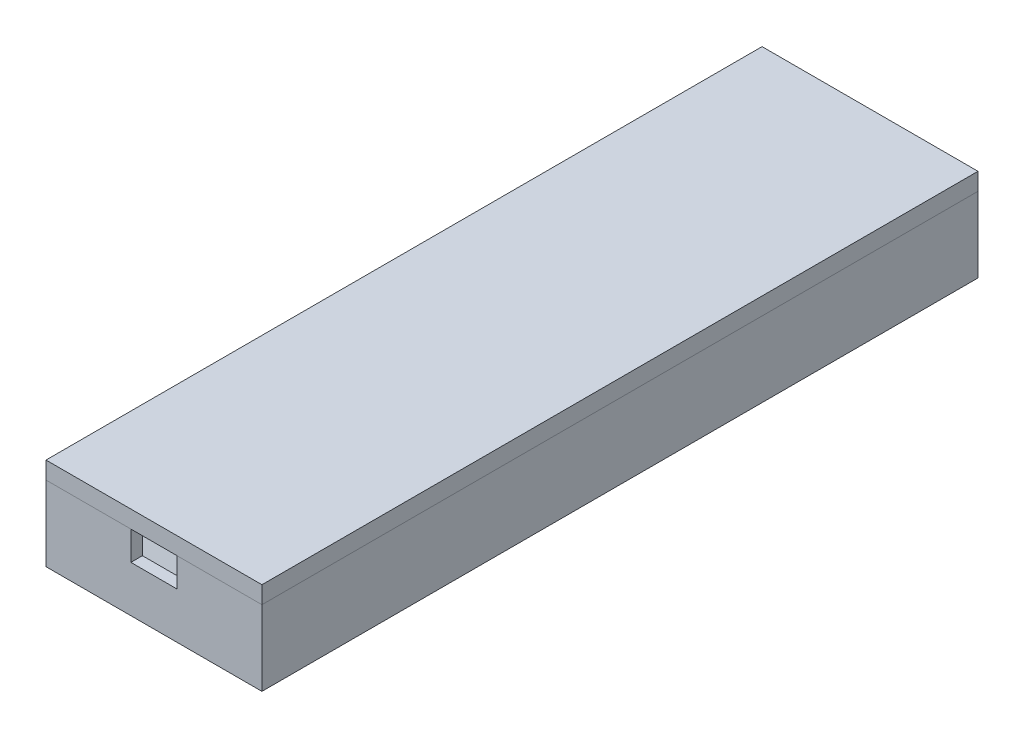
ISO-10303-21;
HEADER;
FILE_DESCRIPTION(('STEP AP214'),'2;1');
FILE_NAME('part.step','',(''),(''),'','','');
FILE_SCHEMA(('AUTOMOTIVE_DESIGN { 1 0 10303 214 1 1 1 1 }'));
ENDSEC;
DATA;
#1=APPLICATION_CONTEXT('core data for automotive mechanical design processes');
#2=APPLICATION_PROTOCOL_DEFINITION('international standard','automotive_design',2000,#1);
#3=PRODUCT_CONTEXT('',#1,'mechanical');
#4=PRODUCT('Part','Part','',(#3));
#5=PRODUCT_RELATED_PRODUCT_CATEGORY('part','',(#4));
#6=PRODUCT_DEFINITION_FORMATION('','',#4);
#7=PRODUCT_DEFINITION_CONTEXT('part definition',#1,'design');
#8=PRODUCT_DEFINITION('design','',#6,#7);
#9=PRODUCT_DEFINITION_SHAPE('','',#8);
#10=(LENGTH_UNIT() NAMED_UNIT(*) SI_UNIT(.MILLI.,.METRE.));
#11=(NAMED_UNIT(*) PLANE_ANGLE_UNIT() SI_UNIT($,.RADIAN.));
#12=(NAMED_UNIT(*) SI_UNIT($,.STERADIAN.) SOLID_ANGLE_UNIT());
#13=UNCERTAINTY_MEASURE_WITH_UNIT(LENGTH_MEASURE(1.E-05),#10,'distance_accuracy_value','');
#14=(GEOMETRIC_REPRESENTATION_CONTEXT(3) GLOBAL_UNCERTAINTY_ASSIGNED_CONTEXT((#13)) GLOBAL_UNIT_ASSIGNED_CONTEXT((#10,
#11,#12)) REPRESENTATION_CONTEXT('',''));
#15=CARTESIAN_POINT('',(0.,0.,0.));
#16=DIRECTION('',(0.,0.,1.));
#17=DIRECTION('',(1.,0.,0.));
#18=AXIS2_PLACEMENT_3D('',#15,#16,#17);
#19=CARTESIAN_POINT('',(-18.6968557711749,16.,-2.));
#20=DIRECTION('',(1.,0.,0.));
#21=DIRECTION('',(0.,1.,0.));
#22=AXIS2_PLACEMENT_3D('',#19,#20,#21);
#23=PLANE('',#22);
#24=DIRECTION('',(0.,0.,1.));
#25=VECTOR('',#24,1.);
#26=CARTESIAN_POINT('',(-18.6968557711749,13.,-2.));
#27=LINE('',#26,#25);
#28=CARTESIAN_POINT('',(-18.6968557711749,13.,-2.));
#29=VERTEX_POINT('',#28);
#30=CARTESIAN_POINT('',(-18.6968557711749,13.,122.));
#31=VERTEX_POINT('',#30);
#32=EDGE_CURVE('E106',#29,#31,#27,.T.);
#33=ORIENTED_EDGE('',*,*,#32,.T.);
#34=DIRECTION('',(0.,-1.,0.));
#35=VECTOR('',#34,1.);
#36=CARTESIAN_POINT('',(-18.6968557711749,16.,122.));
#37=LINE('',#36,#35);
#38=CARTESIAN_POINT('',(-18.6968557711749,16.,122.));
#39=VERTEX_POINT('',#38);
#40=EDGE_CURVE('E12',#39,#31,#37,.T.);
#41=ORIENTED_EDGE('',*,*,#40,.F.);
#42=DIRECTION('',(0.,0.,1.));
#43=VECTOR('',#42,1.);
#44=CARTESIAN_POINT('',(-18.6968557711749,16.,-2.));
#45=LINE('',#44,#43);
#46=CARTESIAN_POINT('',(-18.6968557711749,16.,-2.));
#47=VERTEX_POINT('',#46);
#48=EDGE_CURVE('E94',#47,#39,#45,.T.);
#49=ORIENTED_EDGE('',*,*,#48,.F.);
#50=DIRECTION('',(0.,-1.,0.));
#51=VECTOR('',#50,1.);
#52=CARTESIAN_POINT('',(-18.6968557711749,16.,-2.));
#53=LINE('',#52,#51);
#54=EDGE_CURVE('E102',#47,#29,#53,.T.);
#55=ORIENTED_EDGE('',*,*,#54,.T.);
#56=EDGE_LOOP('',(#33,#41,#49,#55));
#57=FACE_BOUND('',#56,.T.);
#58=ADVANCED_FACE('F43',(#57),#23,.F.);
#59=CARTESIAN_POINT('',(-18.6968557711749,16.,122.));
#60=DIRECTION('',(0.,0.,-1.));
#61=DIRECTION('',(-1.,0.,0.));
#62=AXIS2_PLACEMENT_3D('',#59,#60,#61);
#63=PLANE('',#62);
#64=DIRECTION('',(1.,0.,0.));
#65=VECTOR('',#64,1.);
#66=CARTESIAN_POINT('',(-18.6968557711749,13.,122.));
#67=LINE('',#66,#65);
#68=CARTESIAN_POINT('',(18.6968557711749,13.,122.));
#69=VERTEX_POINT('',#68);
#70=EDGE_CURVE('E98',#31,#69,#67,.T.);
#71=ORIENTED_EDGE('',*,*,#70,.T.);
#72=DIRECTION('',(0.,-1.,0.));
#73=VECTOR('',#72,1.);
#74=CARTESIAN_POINT('',(18.6968557711749,16.,122.));
#75=LINE('',#74,#73);
#76=CARTESIAN_POINT('',(18.6968557711749,16.,122.));
#77=VERTEX_POINT('',#76);
#78=EDGE_CURVE('E51',#77,#69,#75,.T.);
#79=ORIENTED_EDGE('',*,*,#78,.F.);
#80=DIRECTION('',(1.,0.,0.));
#81=VECTOR('',#80,1.);
#82=CARTESIAN_POINT('',(-18.6968557711749,16.,122.));
#83=LINE('',#82,#81);
#84=EDGE_CURVE('E89',#39,#77,#83,.T.);
#85=ORIENTED_EDGE('',*,*,#84,.F.);
#86=ORIENTED_EDGE('',*,*,#40,.T.);
#87=EDGE_LOOP('',(#71,#79,#85,#86));
#88=FACE_BOUND('',#87,.T.);
#89=ADVANCED_FACE('F97',(#88),#63,.F.);
#90=CARTESIAN_POINT('',(18.6968557711749,16.,-2.));
#91=DIRECTION('',(-1.,0.,0.));
#92=DIRECTION('',(0.,-1.,0.));
#93=AXIS2_PLACEMENT_3D('',#90,#91,#92);
#94=PLANE('',#93);
#95=DIRECTION('',(0.,0.,-1.));
#96=VECTOR('',#95,1.);
#97=CARTESIAN_POINT('',(18.6968557711749,13.,-2.));
#98=LINE('',#97,#96);
#99=CARTESIAN_POINT('',(18.6968557711749,13.,-2.));
#100=VERTEX_POINT('',#99);
#101=EDGE_CURVE('E76',#69,#100,#98,.T.);
#102=ORIENTED_EDGE('',*,*,#101,.T.);
#103=DIRECTION('',(0.,-1.,0.));
#104=VECTOR('',#103,1.);
#105=CARTESIAN_POINT('',(18.6968557711749,16.,-2.));
#106=LINE('',#105,#104);
#107=CARTESIAN_POINT('',(18.6968557711749,16.,-2.));
#108=VERTEX_POINT('',#107);
#109=EDGE_CURVE('E99',#108,#100,#106,.T.);
#110=ORIENTED_EDGE('',*,*,#109,.F.);
#111=DIRECTION('',(0.,0.,-1.));
#112=VECTOR('',#111,1.);
#113=CARTESIAN_POINT('',(18.6968557711749,16.,-2.));
#114=LINE('',#113,#112);
#115=EDGE_CURVE('E92',#77,#108,#114,.T.);
#116=ORIENTED_EDGE('',*,*,#115,.F.);
#117=ORIENTED_EDGE('',*,*,#78,.T.);
#118=EDGE_LOOP('',(#102,#110,#116,#117));
#119=FACE_BOUND('',#118,.T.);
#120=ADVANCED_FACE('F100',(#119),#94,.F.);
#121=CARTESIAN_POINT('',(-18.6968557711749,16.,-2.));
#122=DIRECTION('',(0.,0.,1.));
#123=DIRECTION('',(1.,0.,0.));
#124=AXIS2_PLACEMENT_3D('',#121,#122,#123);
#125=PLANE('',#124);
#126=DIRECTION('',(-1.,0.,0.));
#127=VECTOR('',#126,1.);
#128=CARTESIAN_POINT('',(-18.6968557711749,13.,-2.));
#129=LINE('',#128,#127);
#130=EDGE_CURVE('E82',#100,#29,#129,.T.);
#131=ORIENTED_EDGE('',*,*,#130,.T.);
#132=ORIENTED_EDGE('',*,*,#54,.F.);
#133=DIRECTION('',(-1.,0.,0.));
#134=VECTOR('',#133,1.);
#135=CARTESIAN_POINT('',(-18.6968557711749,16.,-2.));
#136=LINE('',#135,#134);
#137=EDGE_CURVE('E59',#108,#47,#136,.T.);
#138=ORIENTED_EDGE('',*,*,#137,.F.);
#139=ORIENTED_EDGE('',*,*,#109,.T.);
#140=EDGE_LOOP('',(#131,#132,#138,#139));
#141=FACE_BOUND('',#140,.T.);
#142=ADVANCED_FACE('F113',(#141),#125,.F.);
#143=CARTESIAN_POINT('',(0.,16.,0.));
#144=DIRECTION('',(0.,1.,0.));
#145=DIRECTION('',(-1.,0.,0.));
#146=AXIS2_PLACEMENT_3D('',#143,#144,#145);
#147=PLANE('',#146);
#148=ORIENTED_EDGE('',*,*,#48,.T.);
#149=ORIENTED_EDGE('',*,*,#84,.T.);
#150=ORIENTED_EDGE('',*,*,#115,.T.);
#151=ORIENTED_EDGE('',*,*,#137,.T.);
#152=EDGE_LOOP('',(#148,#149,#150,#151));
#153=FACE_BOUND('',#152,.T.);
#154=ADVANCED_FACE('F90',(#153),#147,.T.);
#155=CARTESIAN_POINT('',(0.,13.,0.));
#156=DIRECTION('',(0.,1.,0.));
#157=DIRECTION('',(-1.,0.,0.));
#158=AXIS2_PLACEMENT_3D('',#155,#156,#157);
#159=PLANE('',#158);
#160=ORIENTED_EDGE('',*,*,#32,.F.);
#161=ORIENTED_EDGE('',*,*,#130,.F.);
#162=ORIENTED_EDGE('',*,*,#101,.F.);
#163=ORIENTED_EDGE('',*,*,#70,.F.);
#164=EDGE_LOOP('',(#160,#161,#162,#163));
#165=FACE_BOUND('',#164,.T.);
#166=ADVANCED_FACE('F116',(#165),#159,.F.);
#167=CLOSED_SHELL('',(#58,#89,#120,#142,#154,#166));
#168=MANIFOLD_SOLID_BREP('B2',#167);
#169=CARTESIAN_POINT('',(-18.6968557711749,13.,120.));
#170=DIRECTION('',(1.,0.,0.));
#171=DIRECTION('',(0.,1.,0.));
#172=AXIS2_PLACEMENT_3D('',#169,#170,#171);
#173=PLANE('',#172);
#174=DIRECTION('',(0.,0.,-1.));
#175=VECTOR('',#174,1.);
#176=CARTESIAN_POINT('',(-18.6968557711749,13.,120.));
#177=LINE('',#176,#175);
#178=CARTESIAN_POINT('',(-18.6968557711749,13.,122.));
#179=VERTEX_POINT('',#178);
#180=CARTESIAN_POINT('',(-18.6968557711749,13.,-2.));
#181=VERTEX_POINT('',#180);
#182=EDGE_CURVE('E323',#179,#181,#177,.T.);
#183=ORIENTED_EDGE('',*,*,#182,.T.);
#184=DIRECTION('',(0.,1.,0.));
#185=VECTOR('',#184,1.);
#186=CARTESIAN_POINT('',(-18.6968557711749,0.,-2.));
#187=LINE('',#186,#185);
#188=CARTESIAN_POINT('',(-18.6968557711749,0.,-2.));
#189=VERTEX_POINT('',#188);
#190=EDGE_CURVE('E330',#189,#181,#187,.T.);
#191=ORIENTED_EDGE('',*,*,#190,.F.);
#192=DIRECTION('',(0.,0.,-1.));
#193=VECTOR('',#192,1.);
#194=CARTESIAN_POINT('',(-18.6968557711749,0.,120.));
#195=LINE('',#194,#193);
#196=CARTESIAN_POINT('',(-18.6968557711749,0.,122.));
#197=VERTEX_POINT('',#196);
#198=EDGE_CURVE('E307',#197,#189,#195,.T.);
#199=ORIENTED_EDGE('',*,*,#198,.F.);
#200=DIRECTION('',(0.,-1.,0.));
#201=VECTOR('',#200,1.);
#202=CARTESIAN_POINT('',(-18.6968557711749,0.,122.));
#203=LINE('',#202,#201);
#204=EDGE_CURVE('E284',#179,#197,#203,.T.);
#205=ORIENTED_EDGE('',*,*,#204,.F.);
#206=EDGE_LOOP('',(#183,#191,#199,#205));
#207=FACE_BOUND('',#206,.T.);
#208=ADVANCED_FACE('F167',(#207),#173,.F.);
#209=CARTESIAN_POINT('',(-18.6968557711749,0.,120.));
#210=DIRECTION('',(0.,1.,0.));
#211=DIRECTION('',(-1.,0.,0.));
#212=AXIS2_PLACEMENT_3D('',#209,#210,#211);
#213=PLANE('',#212);
#214=ORIENTED_EDGE('',*,*,#198,.T.);
#215=DIRECTION('',(-1.,0.,0.));
#216=VECTOR('',#215,1.);
#217=CARTESIAN_POINT('',(18.6968557711749,0.,-2.));
#218=LINE('',#217,#216);
#219=CARTESIAN_POINT('',(18.6968557711749,0.,-2.));
#220=VERTEX_POINT('',#219);
#221=EDGE_CURVE('E337',#220,#189,#218,.T.);
#222=ORIENTED_EDGE('',*,*,#221,.F.);
#223=DIRECTION('',(0.,0.,-1.));
#224=VECTOR('',#223,1.);
#225=CARTESIAN_POINT('',(18.6968557711749,0.,120.));
#226=LINE('',#225,#224);
#227=CARTESIAN_POINT('',(18.6968557711749,0.,122.));
#228=VERTEX_POINT('',#227);
#229=EDGE_CURVE('E334',#228,#220,#226,.T.);
#230=ORIENTED_EDGE('',*,*,#229,.F.);
#231=DIRECTION('',(1.,0.,0.));
#232=VECTOR('',#231,1.);
#233=CARTESIAN_POINT('',(-18.6968557711749,0.,122.));
#234=LINE('',#233,#232);
#235=EDGE_CURVE('E287',#197,#228,#234,.T.);
#236=ORIENTED_EDGE('',*,*,#235,.F.);
#237=EDGE_LOOP('',(#214,#222,#230,#236));
#238=FACE_BOUND('',#237,.T.);
#239=ADVANCED_FACE('F336',(#238),#213,.F.);
#240=CARTESIAN_POINT('',(18.6968557711749,0.,120.));
#241=DIRECTION('',(-1.,0.,0.));
#242=DIRECTION('',(0.,-1.,0.));
#243=AXIS2_PLACEMENT_3D('',#240,#241,#242);
#244=PLANE('',#243);
#245=ORIENTED_EDGE('',*,*,#229,.T.);
#246=DIRECTION('',(0.,-1.,0.));
#247=VECTOR('',#246,1.);
#248=CARTESIAN_POINT('',(18.6968557711749,0.,-2.));
#249=LINE('',#248,#247);
#250=CARTESIAN_POINT('',(18.6968557711749,13.,-2.));
#251=VERTEX_POINT('',#250);
#252=EDGE_CURVE('E374',#251,#220,#249,.T.);
#253=ORIENTED_EDGE('',*,*,#252,.F.);
#254=DIRECTION('',(0.,0.,-1.));
#255=VECTOR('',#254,1.);
#256=CARTESIAN_POINT('',(18.6968557711749,13.,120.));
#257=LINE('',#256,#255);
#258=CARTESIAN_POINT('',(18.6968557711749,13.,122.));
#259=VERTEX_POINT('',#258);
#260=EDGE_CURVE('E341',#259,#251,#257,.T.);
#261=ORIENTED_EDGE('',*,*,#260,.F.);
#262=DIRECTION('',(0.,1.,0.));
#263=VECTOR('',#262,1.);
#264=CARTESIAN_POINT('',(18.6968557711749,0.,122.));
#265=LINE('',#264,#263);
#266=EDGE_CURVE('E291',#228,#259,#265,.T.);
#267=ORIENTED_EDGE('',*,*,#266,.F.);
#268=EDGE_LOOP('',(#245,#253,#261,#267));
#269=FACE_BOUND('',#268,.T.);
#270=ADVANCED_FACE('F373',(#269),#244,.F.);
#271=CARTESIAN_POINT('',(15.6968557711749,13.,120.));
#272=DIRECTION('',(0.537299608346824,-0.843391445812886,0.));
#273=DIRECTION('',(0.843391445812886,0.537299608346824,0.));
#274=AXIS2_PLACEMENT_3D('',#271,#272,#273);
#275=PLANE('',#274);
#276=DIRECTION('',(-0.843391445812886,-0.537299608346824,0.));
#277=VECTOR('',#276,1.);
#278=CARTESIAN_POINT('',(15.6968557711749,13.,0.));
#279=LINE('',#278,#277);
#280=CARTESIAN_POINT('',(15.6968557711749,13.,0.));
#281=VERTEX_POINT('',#280);
#282=CARTESIAN_POINT('',(0.,2.99999999999999,0.));
#283=VERTEX_POINT('',#282);
#284=EDGE_CURVE('E204',#281,#283,#279,.T.);
#285=ORIENTED_EDGE('',*,*,#284,.T.);
#286=DIRECTION('',(0.,0.,-1.));
#287=VECTOR('',#286,1.);
#288=CARTESIAN_POINT('',(0.,2.99999999999999,120.));
#289=LINE('',#288,#287);
#290=CARTESIAN_POINT('',(0.,2.99999999999999,120.));
#291=VERTEX_POINT('',#290);
#292=EDGE_CURVE('E190',#291,#283,#289,.T.);
#293=ORIENTED_EDGE('',*,*,#292,.F.);
#294=DIRECTION('',(-0.843391445812886,-0.537299608346824,0.));
#295=VECTOR('',#294,1.);
#296=CARTESIAN_POINT('',(15.6968557711749,13.,120.));
#297=LINE('',#296,#295);
#298=CARTESIAN_POINT('',(15.6968557711749,13.,120.));
#299=VERTEX_POINT('',#298);
#300=EDGE_CURVE('E357',#299,#291,#297,.T.);
#301=ORIENTED_EDGE('',*,*,#300,.F.);
#302=DIRECTION('',(0.,0.,-1.));
#303=VECTOR('',#302,1.);
#304=CARTESIAN_POINT('',(15.6968557711749,13.,120.));
#305=LINE('',#304,#303);
#306=EDGE_CURVE('E343',#299,#281,#305,.T.);
#307=ORIENTED_EDGE('',*,*,#306,.T.);
#308=EDGE_LOOP('',(#285,#293,#301,#307));
#309=FACE_BOUND('',#308,.T.);
#310=ADVANCED_FACE('F371',(#309),#275,.F.);
#311=CARTESIAN_POINT('',(0.,2.99999999999999,120.));
#312=DIRECTION('',(-0.537299608346824,-0.843391445812886,0.));
#313=DIRECTION('',(0.843391445812886,-0.537299608346824,0.));
#314=AXIS2_PLACEMENT_3D('',#311,#312,#313);
#315=PLANE('',#314);
#316=DIRECTION('',(-0.843391445812886,0.537299608346824,0.));
#317=VECTOR('',#316,1.);
#318=CARTESIAN_POINT('',(0.,2.99999999999999,0.));
#319=LINE('',#318,#317);
#320=CARTESIAN_POINT('',(-15.6968557711749,13.,0.));
#321=VERTEX_POINT('',#320);
#322=EDGE_CURVE('E202',#283,#321,#319,.T.);
#323=ORIENTED_EDGE('',*,*,#322,.T.);
#324=DIRECTION('',(0.,0.,-1.));
#325=VECTOR('',#324,1.);
#326=CARTESIAN_POINT('',(-15.6968557711749,13.,120.));
#327=LINE('',#326,#325);
#328=CARTESIAN_POINT('',(-15.696855771175,13.,120.));
#329=VERTEX_POINT('',#328);
#330=EDGE_CURVE('E358',#329,#321,#327,.T.);
#331=ORIENTED_EDGE('',*,*,#330,.F.);
#332=DIRECTION('',(-0.843391445812886,0.537299608346824,0.));
#333=VECTOR('',#332,1.);
#334=CARTESIAN_POINT('',(0.,2.99999999999999,120.));
#335=LINE('',#334,#333);
#336=EDGE_CURVE('E365',#291,#329,#335,.T.);
#337=ORIENTED_EDGE('',*,*,#336,.F.);
#338=ORIENTED_EDGE('',*,*,#292,.T.);
#339=EDGE_LOOP('',(#323,#331,#337,#338));
#340=FACE_BOUND('',#339,.T.);
#341=ADVANCED_FACE('F367',(#340),#315,.F.);
#342=CARTESIAN_POINT('',(-15.6968557711749,13.,120.));
#343=DIRECTION('',(0.,-1.,0.));
#344=DIRECTION('',(0.,0.,-1.));
#345=AXIS2_PLACEMENT_3D('',#342,#343,#344);
#346=PLANE('',#345);
#347=DIRECTION('',(-1.,0.,0.));
#348=VECTOR('',#347,1.);
#349=CARTESIAN_POINT('',(-18.6968557711749,13.,122.));
#350=LINE('',#349,#348);
#351=CARTESIAN_POINT('',(-4.,13.,122.));
#352=VERTEX_POINT('',#351);
#353=EDGE_CURVE('E294',#352,#179,#350,.T.);
#354=ORIENTED_EDGE('',*,*,#353,.F.);
#355=DIRECTION('',(0.,0.,1.));
#356=VECTOR('',#355,1.);
#357=CARTESIAN_POINT('',(-4.,13.,119.));
#358=LINE('',#357,#356);
#359=CARTESIAN_POINT('',(-4.,13.,120.));
#360=VERTEX_POINT('',#359);
#361=EDGE_CURVE('E269',#360,#352,#358,.T.);
#362=ORIENTED_EDGE('',*,*,#361,.F.);
#363=DIRECTION('',(-1.,0.,0.));
#364=VECTOR('',#363,1.);
#365=CARTESIAN_POINT('',(-18.6968557711749,13.,120.));
#366=LINE('',#365,#364);
#367=EDGE_CURVE('E279',#360,#329,#366,.T.);
#368=ORIENTED_EDGE('',*,*,#367,.T.);
#369=ORIENTED_EDGE('',*,*,#330,.T.);
#370=DIRECTION('',(1.,0.,0.));
#371=VECTOR('',#370,1.);
#372=CARTESIAN_POINT('',(18.6968557711749,13.,0.));
#373=LINE('',#372,#371);
#374=EDGE_CURVE('E297',#321,#281,#373,.T.);
#375=ORIENTED_EDGE('',*,*,#374,.T.);
#376=ORIENTED_EDGE('',*,*,#306,.F.);
#377=CARTESIAN_POINT('',(4.,13.,120.));
#378=VERTEX_POINT('',#377);
#379=EDGE_CURVE('E288',#299,#378,#366,.T.);
#380=ORIENTED_EDGE('',*,*,#379,.T.);
#381=DIRECTION('',(0.,0.,1.));
#382=VECTOR('',#381,1.);
#383=CARTESIAN_POINT('',(4.,13.,119.));
#384=LINE('',#383,#382);
#385=CARTESIAN_POINT('',(4.,13.,122.));
#386=VERTEX_POINT('',#385);
#387=EDGE_CURVE('E280',#378,#386,#384,.T.);
#388=ORIENTED_EDGE('',*,*,#387,.T.);
#389=EDGE_CURVE('E295',#259,#386,#350,.T.);
#390=ORIENTED_EDGE('',*,*,#389,.F.);
#391=ORIENTED_EDGE('',*,*,#260,.T.);
#392=DIRECTION('',(1.,0.,0.));
#393=VECTOR('',#392,1.);
#394=CARTESIAN_POINT('',(18.6968557711749,13.,-2.));
#395=LINE('',#394,#393);
#396=EDGE_CURVE('E348',#181,#251,#395,.T.);
#397=ORIENTED_EDGE('',*,*,#396,.F.);
#398=ORIENTED_EDGE('',*,*,#182,.F.);
#399=EDGE_LOOP('',(#354,#362,#368,#369,#375,#376,#380,#388,#390,#391,#397,#398));
#400=FACE_BOUND('',#399,.T.);
#401=ADVANCED_FACE('F318',(#400),#346,.F.);
#402=CARTESIAN_POINT('',(0.,0.,0.));
#403=DIRECTION('',(0.,0.,1.));
#404=DIRECTION('',(1.,0.,0.));
#405=AXIS2_PLACEMENT_3D('',#402,#403,#404);
#406=PLANE('',#405);
#407=ORIENTED_EDGE('',*,*,#322,.F.);
#408=ORIENTED_EDGE('',*,*,#284,.F.);
#409=ORIENTED_EDGE('',*,*,#374,.F.);
#410=EDGE_LOOP('',(#407,#408,#409));
#411=FACE_BOUND('',#410,.T.);
#412=ADVANCED_FACE('F384',(#411),#406,.T.);
#413=CARTESIAN_POINT('',(0.,0.,-2.));
#414=DIRECTION('',(0.,0.,1.));
#415=DIRECTION('',(1.,0.,0.));
#416=AXIS2_PLACEMENT_3D('',#413,#414,#415);
#417=PLANE('',#416);
#418=ORIENTED_EDGE('',*,*,#252,.T.);
#419=ORIENTED_EDGE('',*,*,#221,.T.);
#420=ORIENTED_EDGE('',*,*,#190,.T.);
#421=ORIENTED_EDGE('',*,*,#396,.T.);
#422=EDGE_LOOP('',(#418,#419,#420,#421));
#423=FACE_BOUND('',#422,.T.);
#424=ADVANCED_FACE('F377',(#423),#417,.F.);
#425=CARTESIAN_POINT('',(0.,0.,122.));
#426=DIRECTION('',(0.,0.,-1.));
#427=DIRECTION('',(-1.,0.,0.));
#428=AXIS2_PLACEMENT_3D('',#425,#426,#427);
#429=PLANE('',#428);
#430=DIRECTION('',(1.,0.,0.));
#431=VECTOR('',#430,1.);
#432=CARTESIAN_POINT('',(-4.,8.00000000000001,122.));
#433=LINE('',#432,#431);
#434=CARTESIAN_POINT('',(-4.,8.00000000000001,122.));
#435=VERTEX_POINT('',#434);
#436=CARTESIAN_POINT('',(4.,8.00000000000001,122.));
#437=VERTEX_POINT('',#436);
#438=EDGE_CURVE('E257',#435,#437,#433,.T.);
#439=ORIENTED_EDGE('',*,*,#438,.F.);
#440=DIRECTION('',(0.,-1.,0.));
#441=VECTOR('',#440,1.);
#442=CARTESIAN_POINT('',(-4.,13.,122.));
#443=LINE('',#442,#441);
#444=EDGE_CURVE('E266',#352,#435,#443,.T.);
#445=ORIENTED_EDGE('',*,*,#444,.F.);
#446=ORIENTED_EDGE('',*,*,#353,.T.);
#447=ORIENTED_EDGE('',*,*,#204,.T.);
#448=ORIENTED_EDGE('',*,*,#235,.T.);
#449=ORIENTED_EDGE('',*,*,#266,.T.);
#450=ORIENTED_EDGE('',*,*,#389,.T.);
#451=DIRECTION('',(0.,1.,0.));
#452=VECTOR('',#451,1.);
#453=CARTESIAN_POINT('',(4.,13.,122.));
#454=LINE('',#453,#452);
#455=EDGE_CURVE('E263',#437,#386,#454,.T.);
#456=ORIENTED_EDGE('',*,*,#455,.F.);
#457=EDGE_LOOP('',(#439,#445,#446,#447,#448,#449,#450,#456));
#458=FACE_BOUND('',#457,.T.);
#459=ADVANCED_FACE('F273',(#458),#429,.F.);
#460=CARTESIAN_POINT('',(0.,0.,120.));
#461=DIRECTION('',(0.,0.,-1.));
#462=DIRECTION('',(-1.,0.,0.));
#463=AXIS2_PLACEMENT_3D('',#460,#461,#462);
#464=PLANE('',#463);
#465=DIRECTION('',(0.,1.,0.));
#466=VECTOR('',#465,1.);
#467=CARTESIAN_POINT('',(-4.,0.,120.));
#468=LINE('',#467,#466);
#469=CARTESIAN_POINT('',(-4.,8.00000000000001,120.));
#470=VERTEX_POINT('',#469);
#471=EDGE_CURVE('E41',#470,#360,#468,.T.);
#472=ORIENTED_EDGE('',*,*,#471,.F.);
#473=DIRECTION('',(-1.,0.,0.));
#474=VECTOR('',#473,1.);
#475=CARTESIAN_POINT('',(0.,8.00000000000001,120.));
#476=LINE('',#475,#474);
#477=CARTESIAN_POINT('',(4.,8.00000000000001,120.));
#478=VERTEX_POINT('',#477);
#479=EDGE_CURVE('E260',#478,#470,#476,.T.);
#480=ORIENTED_EDGE('',*,*,#479,.F.);
#481=DIRECTION('',(0.,-1.,0.));
#482=VECTOR('',#481,1.);
#483=CARTESIAN_POINT('',(4.,0.,120.));
#484=LINE('',#483,#482);
#485=EDGE_CURVE('E174',#378,#478,#484,.T.);
#486=ORIENTED_EDGE('',*,*,#485,.F.);
#487=ORIENTED_EDGE('',*,*,#379,.F.);
#488=ORIENTED_EDGE('',*,*,#300,.T.);
#489=ORIENTED_EDGE('',*,*,#336,.T.);
#490=ORIENTED_EDGE('',*,*,#367,.F.);
#491=EDGE_LOOP('',(#472,#480,#486,#487,#488,#489,#490));
#492=FACE_BOUND('',#491,.T.);
#493=ADVANCED_FACE('F314',(#492),#464,.T.);
#494=CARTESIAN_POINT('',(-4.,13.,119.));
#495=DIRECTION('',(-1.,0.,0.));
#496=DIRECTION('',(0.,-1.,0.));
#497=AXIS2_PLACEMENT_3D('',#494,#495,#496);
#498=PLANE('',#497);
#499=ORIENTED_EDGE('',*,*,#471,.T.);
#500=ORIENTED_EDGE('',*,*,#361,.T.);
#501=ORIENTED_EDGE('',*,*,#444,.T.);
#502=DIRECTION('',(0.,0.,1.));
#503=VECTOR('',#502,1.);
#504=CARTESIAN_POINT('',(-4.,8.00000000000001,119.));
#505=LINE('',#504,#503);
#506=EDGE_CURVE('E253',#470,#435,#505,.T.);
#507=ORIENTED_EDGE('',*,*,#506,.F.);
#508=EDGE_LOOP('',(#499,#500,#501,#507));
#509=FACE_BOUND('',#508,.T.);
#510=ADVANCED_FACE('F267',(#509),#498,.F.);
#511=CARTESIAN_POINT('',(4.,13.,119.));
#512=DIRECTION('',(1.,0.,0.));
#513=DIRECTION('',(0.,1.,0.));
#514=AXIS2_PLACEMENT_3D('',#511,#512,#513);
#515=PLANE('',#514);
#516=ORIENTED_EDGE('',*,*,#485,.T.);
#517=DIRECTION('',(0.,0.,1.));
#518=VECTOR('',#517,1.);
#519=CARTESIAN_POINT('',(4.,8.00000000000001,119.));
#520=LINE('',#519,#518);
#521=EDGE_CURVE('E181',#478,#437,#520,.T.);
#522=ORIENTED_EDGE('',*,*,#521,.T.);
#523=ORIENTED_EDGE('',*,*,#455,.T.);
#524=ORIENTED_EDGE('',*,*,#387,.F.);
#525=EDGE_LOOP('',(#516,#522,#523,#524));
#526=FACE_BOUND('',#525,.T.);
#527=ADVANCED_FACE('F310',(#526),#515,.F.);
#528=CARTESIAN_POINT('',(-4.,8.00000000000001,119.));
#529=DIRECTION('',(0.,-1.,0.));
#530=DIRECTION('',(0.,0.,-1.));
#531=AXIS2_PLACEMENT_3D('',#528,#529,#530);
#532=PLANE('',#531);
#533=ORIENTED_EDGE('',*,*,#479,.T.);
#534=ORIENTED_EDGE('',*,*,#506,.T.);
#535=ORIENTED_EDGE('',*,*,#438,.T.);
#536=ORIENTED_EDGE('',*,*,#521,.F.);
#537=EDGE_LOOP('',(#533,#534,#535,#536));
#538=FACE_BOUND('',#537,.T.);
#539=ADVANCED_FACE('F255',(#538),#532,.F.);
#540=CLOSED_SHELL('',(#208,#239,#270,#310,#341,#401,#412,#424,#459,#493,#510,#527,#539));
#541=MANIFOLD_SOLID_BREP('B6',#540);
#542=ADVANCED_BREP_SHAPE_REPRESENTATION('',(#18,#168,#541),#14);
#543=SHAPE_DEFINITION_REPRESENTATION(#9,#542);
ENDSEC;
END-ISO-10303-21;
